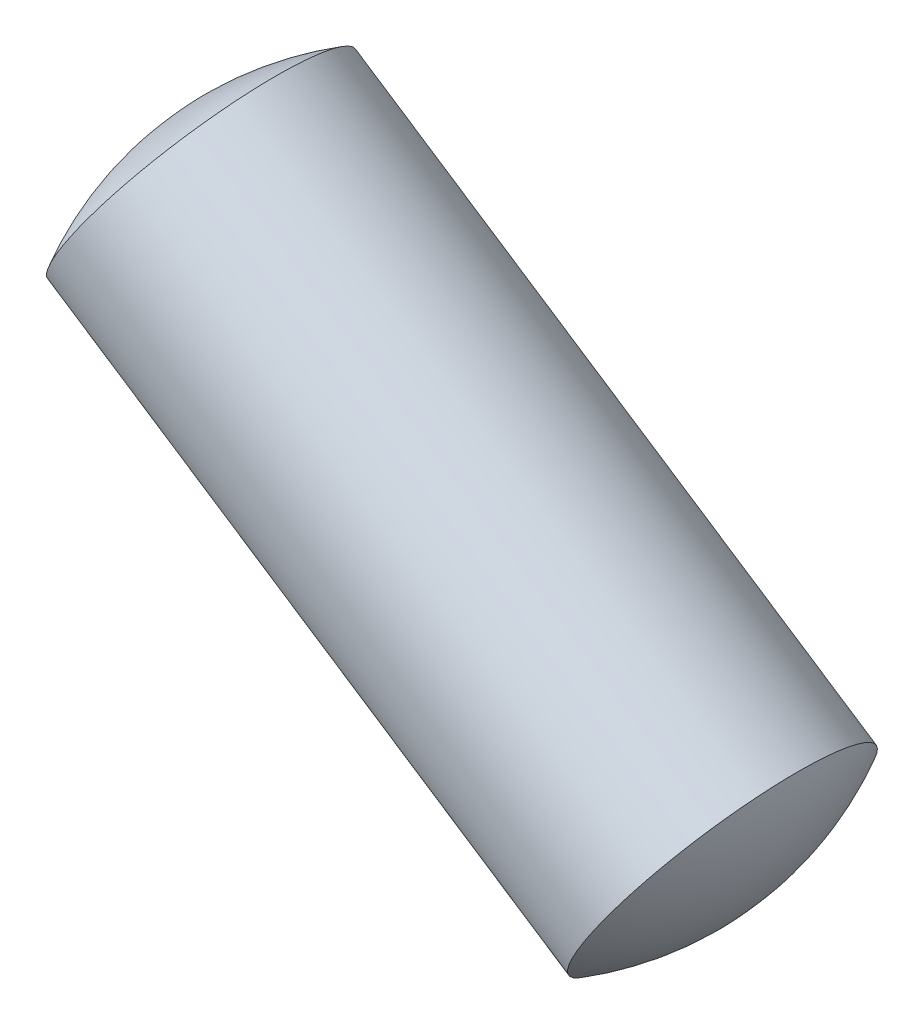
ISO-10303-21;
HEADER;
FILE_DESCRIPTION(('STEP AP214'),'2;1');
FILE_NAME('part.step','',(''),(''),'','','');
FILE_SCHEMA(('AUTOMOTIVE_DESIGN { 1 0 10303 214 1 1 1 1 }'));
ENDSEC;
DATA;
#1=APPLICATION_CONTEXT('core data for automotive mechanical design processes');
#2=APPLICATION_PROTOCOL_DEFINITION('international standard','automotive_design',2000,#1);
#3=PRODUCT_CONTEXT('',#1,'mechanical');
#4=PRODUCT('Part','Part','',(#3));
#5=PRODUCT_RELATED_PRODUCT_CATEGORY('part','',(#4));
#6=PRODUCT_DEFINITION_FORMATION('','',#4);
#7=PRODUCT_DEFINITION_CONTEXT('part definition',#1,'design');
#8=PRODUCT_DEFINITION('design','',#6,#7);
#9=PRODUCT_DEFINITION_SHAPE('','',#8);
#10=(LENGTH_UNIT() NAMED_UNIT(*) SI_UNIT(.MILLI.,.METRE.));
#11=(NAMED_UNIT(*) PLANE_ANGLE_UNIT() SI_UNIT($,.RADIAN.));
#12=(NAMED_UNIT(*) SI_UNIT($,.STERADIAN.) SOLID_ANGLE_UNIT());
#13=UNCERTAINTY_MEASURE_WITH_UNIT(LENGTH_MEASURE(1.E-05),#10,'distance_accuracy_value','');
#14=(GEOMETRIC_REPRESENTATION_CONTEXT(3) GLOBAL_UNCERTAINTY_ASSIGNED_CONTEXT((#13)) GLOBAL_UNIT_ASSIGNED_CONTEXT((#10,
#11,#12)) REPRESENTATION_CONTEXT('',''));
#15=CARTESIAN_POINT('',(0.,0.,0.));
#16=DIRECTION('',(0.,0.,1.));
#17=DIRECTION('',(1.,0.,0.));
#18=AXIS2_PLACEMENT_3D('',#15,#16,#17);
#19=CARTESIAN_POINT('',(-18.6438261375511,12.2586886989098,0.6));
#20=DIRECTION('',(0.549397956907826,0.835560820614219,0.));
#21=DIRECTION('',(-0.835560820614219,0.549397956907825,0.));
#22=AXIS2_PLACEMENT_3D('',#19,#20,#21);
#23=SPHERICAL_SURFACE('',#22,2.);
#24=CARTESIAN_POINT('',(-18.6438261375511,12.2586886989098,0.6));
#25=DIRECTION('',(0.835560820614219,-0.549397956907826,0.));
#26=DIRECTION('',(0.,0.,-1.));
#27=AXIS2_PLACEMENT_3D('',#24,#25,#26);
#28=SPHERICAL_SURFACE('',#27,2.);
#29=CARTESIAN_POINT('',(-20.0910599316689,13.2102738738487,0.6));
#30=DIRECTION('',(0.835560820614219,-0.549397956907826,0.));
#31=DIRECTION('',(0.,0.,-1.));
#32=AXIS2_PLACEMENT_3D('',#29,#30,#31);
#33=CIRCLE('',#32,1.);
#34=CARTESIAN_POINT('',(-20.0910599316689,13.2102738738487,-0.4));
#35=VERTEX_POINT('',#34);
#36=EDGE_CURVE('E11',#35,#35,#33,.T.);
#37=ORIENTED_EDGE('',*,*,#36,.F.);
#38=EDGE_LOOP('',(#37));
#39=FACE_BOUND('',#38,.T.);
#40=ADVANCED_FACE('F17',(#39),#28,.T.);
#41=CARTESIAN_POINT('',(-17.7030695591674,11.6401224265806,0.6));
#42=DIRECTION('',(0.549397956907826,0.835560820614219,0.));
#43=DIRECTION('',(0.835560820614219,-0.549397956907825,0.));
#44=AXIS2_PLACEMENT_3D('',#41,#42,#43);
#45=SPHERICAL_SURFACE('',#44,2.);
#46=CARTESIAN_POINT('',(-17.7030695591674,11.6401224265806,0.6));
#47=DIRECTION('',(0.835560820614219,-0.549397956907826,0.));
#48=DIRECTION('',(0.,0.,-1.));
#49=AXIS2_PLACEMENT_3D('',#46,#47,#48);
#50=SPHERICAL_SURFACE('',#49,2.);
#51=CARTESIAN_POINT('',(-16.2558357650497,10.6885372516418,0.6));
#52=DIRECTION('',(0.835560820614219,-0.549397956907826,0.));
#53=DIRECTION('',(0.,0.,-1.));
#54=AXIS2_PLACEMENT_3D('',#51,#52,#53);
#55=CIRCLE('',#54,1.);
#56=CARTESIAN_POINT('',(-16.2558357650497,10.6885372516418,-0.4));
#57=VERTEX_POINT('',#56);
#58=EDGE_CURVE('E20',#57,#57,#55,.T.);
#59=ORIENTED_EDGE('',*,*,#58,.T.);
#60=EDGE_LOOP('',(#59));
#61=FACE_BOUND('',#60,.T.);
#62=ADVANCED_FACE('F39',(#61),#50,.T.);
#63=CARTESIAN_POINT('',(-17.2146418067044,11.3189714071935,0.6));
#64=DIRECTION('',(0.835560820614219,-0.549397956907826,0.));
#65=DIRECTION('',(0.,0.,-1.));
#66=AXIS2_PLACEMENT_3D('',#63,#64,#65);
#67=CYLINDRICAL_SURFACE('',#66,1.);
#68=ORIENTED_EDGE('',*,*,#36,.T.);
#69=EDGE_LOOP('',(#68));
#70=FACE_BOUND('',#69,.T.);
#71=ORIENTED_EDGE('',*,*,#58,.F.);
#72=EDGE_LOOP('',(#71));
#73=FACE_BOUND('',#72,.T.);
#74=ADVANCED_FACE('F47',(#70,#73),#67,.T.);
#75=CLOSED_SHELL('',(#40,#62,#74));
#76=MANIFOLD_SOLID_BREP('B1',#75);
#77=ADVANCED_BREP_SHAPE_REPRESENTATION('',(#18,#76),#14);
#78=SHAPE_DEFINITION_REPRESENTATION(#9,#77);
ENDSEC;
END-ISO-10303-21;
